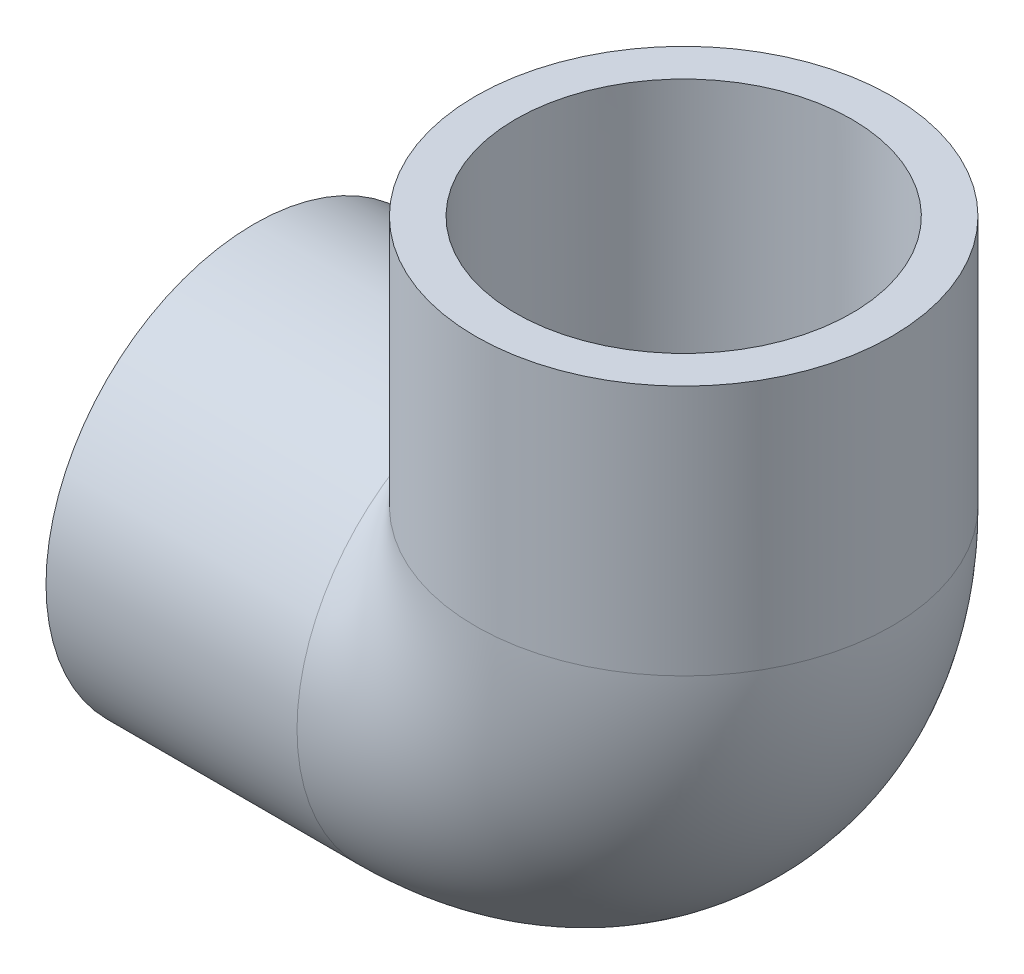
ISO-10303-21;
HEADER;
FILE_DESCRIPTION(('STEP AP214'),'2;1');
FILE_NAME('part.step','',(''),(''),'','','');
FILE_SCHEMA(('AUTOMOTIVE_DESIGN { 1 0 10303 214 1 1 1 1 }'));
ENDSEC;
DATA;
#1=APPLICATION_CONTEXT('core data for automotive mechanical design processes');
#2=APPLICATION_PROTOCOL_DEFINITION('international standard','automotive_design',2000,#1);
#3=PRODUCT_CONTEXT('',#1,'mechanical');
#4=PRODUCT('Part','Part','',(#3));
#5=PRODUCT_RELATED_PRODUCT_CATEGORY('part','',(#4));
#6=PRODUCT_DEFINITION_FORMATION('','',#4);
#7=PRODUCT_DEFINITION_CONTEXT('part definition',#1,'design');
#8=PRODUCT_DEFINITION('design','',#6,#7);
#9=PRODUCT_DEFINITION_SHAPE('','',#8);
#10=(LENGTH_UNIT() NAMED_UNIT(*) SI_UNIT(.MILLI.,.METRE.));
#11=(NAMED_UNIT(*) PLANE_ANGLE_UNIT() SI_UNIT($,.RADIAN.));
#12=(NAMED_UNIT(*) SI_UNIT($,.STERADIAN.) SOLID_ANGLE_UNIT());
#13=UNCERTAINTY_MEASURE_WITH_UNIT(LENGTH_MEASURE(1.E-05),#10,'distance_accuracy_value','');
#14=(GEOMETRIC_REPRESENTATION_CONTEXT(3) GLOBAL_UNCERTAINTY_ASSIGNED_CONTEXT((#13)) GLOBAL_UNIT_ASSIGNED_CONTEXT((#10,
#11,#12)) REPRESENTATION_CONTEXT('',''));
#15=CARTESIAN_POINT('',(0.,0.,0.));
#16=DIRECTION('',(0.,0.,1.));
#17=DIRECTION('',(1.,0.,0.));
#18=AXIS2_PLACEMENT_3D('',#15,#16,#17);
#19=CARTESIAN_POINT('',(-34.3408,-16.637,0.));
#20=DIRECTION('',(-1.,0.,0.));
#21=DIRECTION('',(0.,0.,1.));
#22=AXIS2_PLACEMENT_3D('',#19,#20,#21);
#23=PLANE('',#22);
#24=CARTESIAN_POINT('',(-34.3408,0.,0.));
#25=DIRECTION('',(-1.,0.,0.));
#26=DIRECTION('',(0.,0.,1.));
#27=AXIS2_PLACEMENT_3D('',#24,#25,#26);
#28=CIRCLE('',#27,16.637);
#29=CARTESIAN_POINT('',(-34.3408,0.,16.637));
#30=VERTEX_POINT('',#29);
#31=EDGE_CURVE('E56',#30,#30,#28,.T.);
#32=ORIENTED_EDGE('',*,*,#31,.T.);
#33=EDGE_LOOP('',(#32));
#34=FACE_BOUND('',#33,.T.);
#35=CARTESIAN_POINT('',(-34.3408,0.,0.));
#36=DIRECTION('',(-1.,0.,0.));
#37=DIRECTION('',(0.,0.,1.));
#38=AXIS2_PLACEMENT_3D('',#35,#36,#37);
#39=CIRCLE('',#38,13.4366);
#40=CARTESIAN_POINT('',(-34.3408,0.,13.4366));
#41=VERTEX_POINT('',#40);
#42=EDGE_CURVE('E39',#41,#41,#39,.T.);
#43=ORIENTED_EDGE('',*,*,#42,.F.);
#44=EDGE_LOOP('',(#43));
#45=FACE_BOUND('',#44,.T.);
#46=ADVANCED_FACE('F32',(#34,#45),#23,.T.);
#47=CARTESIAN_POINT('',(-14.2748,0.,0.));
#48=DIRECTION('',(-1.,0.,0.));
#49=DIRECTION('',(0.,0.,1.));
#50=AXIS2_PLACEMENT_3D('',#47,#48,#49);
#51=CONICAL_SURFACE('',#50,13.2842,0.00759479068084232);
#52=ORIENTED_EDGE('',*,*,#42,.T.);
#53=EDGE_LOOP('',(#52));
#54=FACE_BOUND('',#53,.T.);
#55=CARTESIAN_POINT('',(-14.2748,0.,0.));
#56=DIRECTION('',(-1.,0.,0.));
#57=DIRECTION('',(0.,0.,1.));
#58=AXIS2_PLACEMENT_3D('',#55,#56,#57);
#59=CIRCLE('',#58,13.2842);
#60=CARTESIAN_POINT('',(-14.2748,0.,13.2842));
#61=VERTEX_POINT('',#60);
#62=EDGE_CURVE('E55',#61,#61,#59,.T.);
#63=ORIENTED_EDGE('',*,*,#62,.F.);
#64=EDGE_LOOP('',(#63));
#65=FACE_BOUND('',#64,.T.);
#66=ADVANCED_FACE('F86',(#54,#65),#51,.F.);
#67=CARTESIAN_POINT('',(-34.3408,0.,0.));
#68=DIRECTION('',(-1.,0.,0.));
#69=DIRECTION('',(0.,0.,1.));
#70=AXIS2_PLACEMENT_3D('',#67,#68,#69);
#71=CYLINDRICAL_SURFACE('',#70,16.637);
#72=CARTESIAN_POINT('',(0.,0.,0.));
#73=DIRECTION('',(-0.707106781186547,-0.707106781186547,0.));
#74=DIRECTION('',(-0.707106781186547,0.707106781186547,0.));
#75=AXIS2_PLACEMENT_3D('',#72,#73,#74);
#76=ELLIPSE('',#75,23.5282710372012,16.637);
#77=CARTESIAN_POINT('',(-14.2748,14.2748,-8.54516553145695));
#78=VERTEX_POINT('',#77);
#79=CARTESIAN_POINT('',(-14.2748,14.2748,8.54516553145695));
#80=VERTEX_POINT('',#79);
#81=EDGE_CURVE('E53',#78,#80,#76,.F.);
#82=ORIENTED_EDGE('',*,*,#81,.F.);
#83=CARTESIAN_POINT('',(-14.2748,0.,0.));
#84=DIRECTION('',(-1.,0.,0.));
#85=DIRECTION('',(0.,0.,1.));
#86=AXIS2_PLACEMENT_3D('',#83,#84,#85);
#87=CIRCLE('',#86,16.637);
#88=EDGE_CURVE('E50',#78,#80,#87,.T.);
#89=ORIENTED_EDGE('',*,*,#88,.T.);
#90=EDGE_LOOP('',(#82,#89));
#91=FACE_BOUND('',#90,.T.);
#92=ORIENTED_EDGE('',*,*,#31,.F.);
#93=EDGE_LOOP('',(#92));
#94=FACE_BOUND('',#93,.T.);
#95=ADVANCED_FACE('F51',(#91,#94),#71,.T.);
#96=CARTESIAN_POINT('',(-14.2748,0.,0.));
#97=DIRECTION('',(1.,0.,0.));
#98=DIRECTION('',(0.,0.,-1.));
#99=AXIS2_PLACEMENT_3D('',#96,#97,#98);
#100=PLANE('',#99);
#101=CARTESIAN_POINT('',(-14.2748,0.,0.));
#102=DIRECTION('',(1.,0.,0.));
#103=DIRECTION('',(0.,0.,-1.));
#104=AXIS2_PLACEMENT_3D('',#101,#102,#103);
#105=CIRCLE('',#104,10.4648);
#106=CARTESIAN_POINT('',(-14.2748,-10.4648,0.));
#107=VERTEX_POINT('',#106);
#108=EDGE_CURVE('E62',#107,#107,#105,.T.);
#109=ORIENTED_EDGE('',*,*,#108,.T.);
#110=EDGE_LOOP('',(#109));
#111=FACE_BOUND('',#110,.T.);
#112=ORIENTED_EDGE('',*,*,#62,.T.);
#113=EDGE_LOOP('',(#112));
#114=FACE_BOUND('',#113,.T.);
#115=ADVANCED_FACE('F96',(#111,#114),#100,.F.);
#116=CARTESIAN_POINT('',(-14.2748,14.2748,0.));
#117=DIRECTION('',(0.,0.,-1.));
#118=DIRECTION('',(-1.,0.,0.));
#119=AXIS2_PLACEMENT_3D('',#116,#117,#118);
#120=TOROIDAL_SURFACE('',#119,14.2748,10.4648);
#121=CARTESIAN_POINT('',(0.,14.2748,0.));
#122=DIRECTION('',(0.,1.,0.));
#123=DIRECTION('',(0.,0.,-1.));
#124=AXIS2_PLACEMENT_3D('',#121,#122,#123);
#125=CIRCLE('',#124,10.4648);
#126=CARTESIAN_POINT('',(10.4648,14.2748,0.));
#127=VERTEX_POINT('',#126);
#128=EDGE_CURVE('E59',#127,#127,#125,.T.);
#129=CARTESIAN_POINT('',(-14.2748,14.2748,0.));
#130=DIRECTION('',(0.,0.,-1.));
#131=DIRECTION('',(-1.,0.,0.));
#132=AXIS2_PLACEMENT_3D('',#129,#130,#131);
#133=CIRCLE('',#132,24.7396);
#134=EDGE_CURVE('',#127,#107,#133,.T.);
#135=ORIENTED_EDGE('',*,*,#128,.T.);
#136=ORIENTED_EDGE('',*,*,#108,.F.);
#137=ORIENTED_EDGE('',*,*,#134,.T.);
#138=ORIENTED_EDGE('',*,*,#134,.F.);
#139=EDGE_LOOP('',(#135,#137,#136,#138));
#140=FACE_BOUND('',#139,.T.);
#141=ADVANCED_FACE('F101',(#140),#120,.F.);
#142=CARTESIAN_POINT('',(-28.5496,14.2748,0.));
#143=DIRECTION('',(0.,-1.,0.));
#144=DIRECTION('',(-1.,0.,0.));
#145=AXIS2_PLACEMENT_3D('',#142,#143,#144);
#146=CIRCLE('',#145,16.637);
#147=TRIMMED_CURVE('',#146,(PARAMETER_VALUE(-2.60218926320794)),
(PARAMETER_VALUE(2.60218926320794)),.T.,.PARAMETER.);
#148=CARTESIAN_POINT('',(-14.2748,14.2748,0.));
#149=DIRECTION('',(0.,0.,-1.));
#150=AXIS1_PLACEMENT('',#148,#149);
#151=SURFACE_OF_REVOLUTION('',#147,#150);
#152=CARTESIAN_POINT('',(0.,14.2748,0.));
#153=DIRECTION('',(0.,1.,0.));
#154=DIRECTION('',(0.,0.,-1.));
#155=AXIS2_PLACEMENT_3D('',#152,#153,#154);
#156=CIRCLE('',#155,16.637);
#157=EDGE_CURVE('E45',#80,#78,#156,.T.);
#158=ORIENTED_EDGE('',*,*,#157,.F.);
#159=ORIENTED_EDGE('',*,*,#88,.F.);
#160=EDGE_LOOP('',(#158,#159));
#161=FACE_BOUND('',#160,.T.);
#162=ADVANCED_FACE('F58',(#161),#151,.T.);
#163=CARTESIAN_POINT('',(0.,14.2748,0.));
#164=DIRECTION('',(0.,1.,0.));
#165=DIRECTION('',(0.,0.,-1.));
#166=AXIS2_PLACEMENT_3D('',#163,#164,#165);
#167=PLANE('',#166);
#168=CARTESIAN_POINT('',(0.,14.2748,0.));
#169=DIRECTION('',(0.,1.,0.));
#170=DIRECTION('',(-1.,0.,0.));
#171=AXIS2_PLACEMENT_3D('',#168,#169,#170);
#172=CIRCLE('',#171,13.2842);
#173=CARTESIAN_POINT('',(-13.2842,14.2748,0.));
#174=VERTEX_POINT('',#173);
#175=EDGE_CURVE('E11',#174,#174,#172,.F.);
#176=ORIENTED_EDGE('',*,*,#175,.F.);
#177=EDGE_LOOP('',(#176));
#178=FACE_BOUND('',#177,.T.);
#179=ORIENTED_EDGE('',*,*,#128,.F.);
#180=EDGE_LOOP('',(#179));
#181=FACE_BOUND('',#180,.T.);
#182=ADVANCED_FACE('F107',(#178,#181),#167,.T.);
#183=CARTESIAN_POINT('',(16.637,34.3408,0.));
#184=DIRECTION('',(0.,1.,0.));
#185=DIRECTION('',(0.,0.,1.));
#186=AXIS2_PLACEMENT_3D('',#183,#184,#185);
#187=PLANE('',#186);
#188=CARTESIAN_POINT('',(0.,34.3408,0.));
#189=DIRECTION('',(0.,-1.,0.));
#190=DIRECTION('',(0.,0.,-1.));
#191=AXIS2_PLACEMENT_3D('',#188,#189,#190);
#192=CIRCLE('',#191,13.4366);
#193=CARTESIAN_POINT('',(0.,34.3408,-13.4366));
#194=VERTEX_POINT('',#193);
#195=EDGE_CURVE('E68',#194,#194,#192,.T.);
#196=ORIENTED_EDGE('',*,*,#195,.T.);
#197=EDGE_LOOP('',(#196));
#198=FACE_BOUND('',#197,.T.);
#199=CARTESIAN_POINT('',(0.,34.3408,0.));
#200=DIRECTION('',(0.,-1.,0.));
#201=DIRECTION('',(0.,0.,-1.));
#202=AXIS2_PLACEMENT_3D('',#199,#200,#201);
#203=CIRCLE('',#202,16.637);
#204=CARTESIAN_POINT('',(0.,34.3408,-16.637));
#205=VERTEX_POINT('',#204);
#206=EDGE_CURVE('E63',#205,#205,#203,.T.);
#207=ORIENTED_EDGE('',*,*,#206,.F.);
#208=EDGE_LOOP('',(#207));
#209=FACE_BOUND('',#208,.T.);
#210=ADVANCED_FACE('F108',(#198,#209),#187,.T.);
#211=CARTESIAN_POINT('',(0.,0.,0.));
#212=DIRECTION('',(0.,-1.,0.));
#213=DIRECTION('',(0.,0.,-1.));
#214=AXIS2_PLACEMENT_3D('',#211,#212,#213);
#215=CYLINDRICAL_SURFACE('',#214,16.637);
#216=ORIENTED_EDGE('',*,*,#206,.T.);
#217=EDGE_LOOP('',(#216));
#218=FACE_BOUND('',#217,.T.);
#219=ORIENTED_EDGE('',*,*,#157,.T.);
#220=ORIENTED_EDGE('',*,*,#81,.T.);
#221=EDGE_LOOP('',(#219,#220));
#222=FACE_BOUND('',#221,.T.);
#223=ADVANCED_FACE('F61',(#218,#222),#215,.T.);
#224=CARTESIAN_POINT('',(0.,34.3408,0.));
#225=DIRECTION('',(0.,1.,0.));
#226=DIRECTION('',(0.,0.,1.));
#227=AXIS2_PLACEMENT_3D('',#224,#225,#226);
#228=CONICAL_SURFACE('',#227,13.4366,0.00759479068084232);
#229=ORIENTED_EDGE('',*,*,#175,.T.);
#230=EDGE_LOOP('',(#229));
#231=FACE_BOUND('',#230,.T.);
#232=ORIENTED_EDGE('',*,*,#195,.F.);
#233=EDGE_LOOP('',(#232));
#234=FACE_BOUND('',#233,.T.);
#235=ADVANCED_FACE('F120',(#231,#234),#228,.F.);
#236=CLOSED_SHELL('',(#46,#66,#95,#115,#141,#162,#182,#210,#223,#235));
#237=MANIFOLD_SOLID_BREP('B2',#236);
#238=ADVANCED_BREP_SHAPE_REPRESENTATION('',(#18,#237),#14);
#239=SHAPE_DEFINITION_REPRESENTATION(#9,#238);
ENDSEC;
END-ISO-10303-21;
